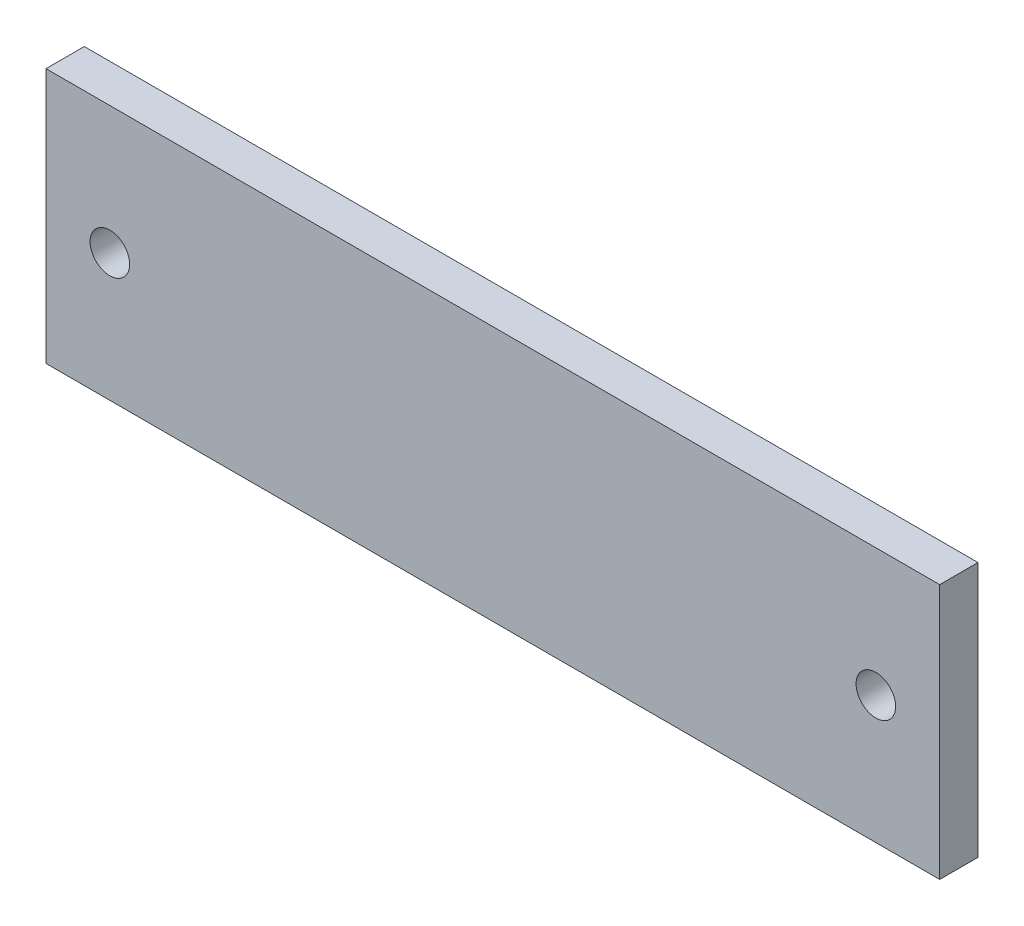
ISO-10303-21;
HEADER;
FILE_DESCRIPTION(('STEP AP214'),'2;1');
FILE_NAME('part.step','',(''),(''),'','','');
FILE_SCHEMA(('AUTOMOTIVE_DESIGN { 1 0 10303 214 1 1 1 1 }'));
ENDSEC;
DATA;
#1=APPLICATION_CONTEXT('core data for automotive mechanical design processes');
#2=APPLICATION_PROTOCOL_DEFINITION('international standard','automotive_design',2000,#1);
#3=PRODUCT_CONTEXT('',#1,'mechanical');
#4=PRODUCT('Part','Part','',(#3));
#5=PRODUCT_RELATED_PRODUCT_CATEGORY('part','',(#4));
#6=PRODUCT_DEFINITION_FORMATION('','',#4);
#7=PRODUCT_DEFINITION_CONTEXT('part definition',#1,'design');
#8=PRODUCT_DEFINITION('design','',#6,#7);
#9=PRODUCT_DEFINITION_SHAPE('','',#8);
#10=(LENGTH_UNIT() NAMED_UNIT(*) SI_UNIT(.MILLI.,.METRE.));
#11=(NAMED_UNIT(*) PLANE_ANGLE_UNIT() SI_UNIT($,.RADIAN.));
#12=(NAMED_UNIT(*) SI_UNIT($,.STERADIAN.) SOLID_ANGLE_UNIT());
#13=UNCERTAINTY_MEASURE_WITH_UNIT(LENGTH_MEASURE(1.E-05),#10,'distance_accuracy_value','');
#14=(GEOMETRIC_REPRESENTATION_CONTEXT(3) GLOBAL_UNCERTAINTY_ASSIGNED_CONTEXT((#13)) GLOBAL_UNIT_ASSIGNED_CONTEXT((#10,
#11,#12)) REPRESENTATION_CONTEXT('',''));
#15=CARTESIAN_POINT('',(0.,0.,0.));
#16=DIRECTION('',(0.,0.,1.));
#17=DIRECTION('',(1.,0.,0.));
#18=AXIS2_PLACEMENT_3D('',#15,#16,#17);
#19=CARTESIAN_POINT('',(0.,0.,3.));
#20=DIRECTION('',(0.,0.,-1.));
#21=DIRECTION('',(-1.,0.,0.));
#22=AXIS2_PLACEMENT_3D('',#19,#20,#21);
#23=PLANE('',#22);
#24=DIRECTION('',(0.,1.,0.));
#25=VECTOR('',#24,1.);
#26=CARTESIAN_POINT('',(35.,-10.,3.));
#27=LINE('',#26,#25);
#28=CARTESIAN_POINT('',(35.,-10.,3.));
#29=VERTEX_POINT('',#28);
#30=CARTESIAN_POINT('',(35.,10.,3.));
#31=VERTEX_POINT('',#30);
#32=EDGE_CURVE('E96',#29,#31,#27,.T.);
#33=ORIENTED_EDGE('',*,*,#32,.T.);
#34=DIRECTION('',(-1.,0.,0.));
#35=VECTOR('',#34,1.);
#36=CARTESIAN_POINT('',(-35.,10.,3.));
#37=LINE('',#36,#35);
#38=CARTESIAN_POINT('',(-35.,10.,3.));
#39=VERTEX_POINT('',#38);
#40=EDGE_CURVE('E91',#31,#39,#37,.T.);
#41=ORIENTED_EDGE('',*,*,#40,.T.);
#42=DIRECTION('',(0.,-1.,0.));
#43=VECTOR('',#42,1.);
#44=CARTESIAN_POINT('',(-35.,-10.,3.));
#45=LINE('',#44,#43);
#46=CARTESIAN_POINT('',(-35.,-10.,3.));
#47=VERTEX_POINT('',#46);
#48=EDGE_CURVE('E94',#39,#47,#45,.T.);
#49=ORIENTED_EDGE('',*,*,#48,.T.);
#50=DIRECTION('',(1.,0.,0.));
#51=VECTOR('',#50,1.);
#52=CARTESIAN_POINT('',(-35.,-10.,3.));
#53=LINE('',#52,#51);
#54=EDGE_CURVE('E61',#47,#29,#53,.T.);
#55=ORIENTED_EDGE('',*,*,#54,.T.);
#56=EDGE_LOOP('',(#33,#41,#49,#55));
#57=FACE_BOUND('',#56,.T.);
#58=CARTESIAN_POINT('',(30.,0.,3.));
#59=DIRECTION('',(0.,0.,1.));
#60=DIRECTION('',(1.,0.,0.));
#61=AXIS2_PLACEMENT_3D('',#58,#59,#60);
#62=CIRCLE('',#61,1.55);
#63=CARTESIAN_POINT('',(31.55,0.,3.));
#64=VERTEX_POINT('',#63);
#65=EDGE_CURVE('E116',#64,#64,#62,.T.);
#66=ORIENTED_EDGE('',*,*,#65,.F.);
#67=EDGE_LOOP('',(#66));
#68=FACE_BOUND('',#67,.T.);
#69=CARTESIAN_POINT('',(-30.,0.,3.));
#70=DIRECTION('',(0.,0.,1.));
#71=DIRECTION('',(-1.,0.,0.));
#72=AXIS2_PLACEMENT_3D('',#69,#70,#71);
#73=CIRCLE('',#72,1.55);
#74=CARTESIAN_POINT('',(-31.55,0.,3.));
#75=VERTEX_POINT('',#74);
#76=EDGE_CURVE('E138',#75,#75,#73,.T.);
#77=ORIENTED_EDGE('',*,*,#76,.F.);
#78=EDGE_LOOP('',(#77));
#79=FACE_BOUND('',#78,.T.);
#80=ADVANCED_FACE('F43',(#57,#68,#79),#23,.F.);
#81=CARTESIAN_POINT('',(0.,0.,0.));
#82=DIRECTION('',(0.,0.,-1.));
#83=DIRECTION('',(-1.,0.,0.));
#84=AXIS2_PLACEMENT_3D('',#81,#82,#83);
#85=PLANE('',#84);
#86=CARTESIAN_POINT('',(30.,0.,0.));
#87=DIRECTION('',(0.,0.,1.));
#88=DIRECTION('',(1.,0.,0.));
#89=AXIS2_PLACEMENT_3D('',#86,#87,#88);
#90=CIRCLE('',#89,1.55);
#91=CARTESIAN_POINT('',(31.55,0.,0.));
#92=VERTEX_POINT('',#91);
#93=EDGE_CURVE('E134',#92,#92,#90,.T.);
#94=ORIENTED_EDGE('',*,*,#93,.T.);
#95=EDGE_LOOP('',(#94));
#96=FACE_BOUND('',#95,.T.);
#97=DIRECTION('',(0.,1.,0.));
#98=VECTOR('',#97,1.);
#99=CARTESIAN_POINT('',(35.,-10.,0.));
#100=LINE('',#99,#98);
#101=CARTESIAN_POINT('',(35.,-10.,0.));
#102=VERTEX_POINT('',#101);
#103=CARTESIAN_POINT('',(35.,10.,0.));
#104=VERTEX_POINT('',#103);
#105=EDGE_CURVE('E112',#102,#104,#100,.T.);
#106=ORIENTED_EDGE('',*,*,#105,.F.);
#107=DIRECTION('',(1.,0.,0.));
#108=VECTOR('',#107,1.);
#109=CARTESIAN_POINT('',(-35.,-10.,0.));
#110=LINE('',#109,#108);
#111=CARTESIAN_POINT('',(-35.,-10.,0.));
#112=VERTEX_POINT('',#111);
#113=EDGE_CURVE('E84',#112,#102,#110,.T.);
#114=ORIENTED_EDGE('',*,*,#113,.F.);
#115=DIRECTION('',(0.,-1.,0.));
#116=VECTOR('',#115,1.);
#117=CARTESIAN_POINT('',(-35.,-10.,0.));
#118=LINE('',#117,#116);
#119=CARTESIAN_POINT('',(-35.,10.,0.));
#120=VERTEX_POINT('',#119);
#121=EDGE_CURVE('E78',#120,#112,#118,.T.);
#122=ORIENTED_EDGE('',*,*,#121,.F.);
#123=DIRECTION('',(-1.,0.,0.));
#124=VECTOR('',#123,1.);
#125=CARTESIAN_POINT('',(-35.,10.,0.));
#126=LINE('',#125,#124);
#127=EDGE_CURVE('E101',#104,#120,#126,.T.);
#128=ORIENTED_EDGE('',*,*,#127,.F.);
#129=EDGE_LOOP('',(#106,#114,#122,#128));
#130=FACE_BOUND('',#129,.T.);
#131=CARTESIAN_POINT('',(-30.,0.,0.));
#132=DIRECTION('',(0.,0.,1.));
#133=DIRECTION('',(-1.,0.,0.));
#134=AXIS2_PLACEMENT_3D('',#131,#132,#133);
#135=CIRCLE('',#134,1.55);
#136=CARTESIAN_POINT('',(-31.55,0.,0.));
#137=VERTEX_POINT('',#136);
#138=EDGE_CURVE('E142',#137,#137,#135,.T.);
#139=ORIENTED_EDGE('',*,*,#138,.T.);
#140=EDGE_LOOP('',(#139));
#141=FACE_BOUND('',#140,.T.);
#142=ADVANCED_FACE('F129',(#96,#130,#141),#85,.T.);
#143=CARTESIAN_POINT('',(35.,-10.,3.));
#144=DIRECTION('',(-1.,0.,0.));
#145=DIRECTION('',(0.,0.,1.));
#146=AXIS2_PLACEMENT_3D('',#143,#144,#145);
#147=PLANE('',#146);
#148=ORIENTED_EDGE('',*,*,#105,.T.);
#149=DIRECTION('',(0.,0.,-1.));
#150=VECTOR('',#149,1.);
#151=CARTESIAN_POINT('',(35.,10.,3.));
#152=LINE('',#151,#150);
#153=EDGE_CURVE('E11',#31,#104,#152,.T.);
#154=ORIENTED_EDGE('',*,*,#153,.F.);
#155=ORIENTED_EDGE('',*,*,#32,.F.);
#156=DIRECTION('',(0.,0.,-1.));
#157=VECTOR('',#156,1.);
#158=CARTESIAN_POINT('',(35.,-10.,3.));
#159=LINE('',#158,#157);
#160=EDGE_CURVE('E108',#29,#102,#159,.T.);
#161=ORIENTED_EDGE('',*,*,#160,.T.);
#162=EDGE_LOOP('',(#148,#154,#155,#161));
#163=FACE_BOUND('',#162,.T.);
#164=ADVANCED_FACE('F45',(#163),#147,.F.);
#165=CARTESIAN_POINT('',(-35.,10.,3.));
#166=DIRECTION('',(0.,-1.,0.));
#167=DIRECTION('',(0.,0.,-1.));
#168=AXIS2_PLACEMENT_3D('',#165,#166,#167);
#169=PLANE('',#168);
#170=ORIENTED_EDGE('',*,*,#127,.T.);
#171=DIRECTION('',(0.,0.,-1.));
#172=VECTOR('',#171,1.);
#173=CARTESIAN_POINT('',(-35.,10.,3.));
#174=LINE('',#173,#172);
#175=EDGE_CURVE('E53',#39,#120,#174,.T.);
#176=ORIENTED_EDGE('',*,*,#175,.F.);
#177=ORIENTED_EDGE('',*,*,#40,.F.);
#178=ORIENTED_EDGE('',*,*,#153,.T.);
#179=EDGE_LOOP('',(#170,#176,#177,#178));
#180=FACE_BOUND('',#179,.T.);
#181=ADVANCED_FACE('F100',(#180),#169,.F.);
#182=CARTESIAN_POINT('',(-35.,-10.,3.));
#183=DIRECTION('',(1.,0.,0.));
#184=DIRECTION('',(0.,0.,-1.));
#185=AXIS2_PLACEMENT_3D('',#182,#183,#184);
#186=PLANE('',#185);
#187=ORIENTED_EDGE('',*,*,#121,.T.);
#188=DIRECTION('',(0.,0.,-1.));
#189=VECTOR('',#188,1.);
#190=CARTESIAN_POINT('',(-35.,-10.,3.));
#191=LINE('',#190,#189);
#192=EDGE_CURVE('E103',#47,#112,#191,.T.);
#193=ORIENTED_EDGE('',*,*,#192,.F.);
#194=ORIENTED_EDGE('',*,*,#48,.F.);
#195=ORIENTED_EDGE('',*,*,#175,.T.);
#196=EDGE_LOOP('',(#187,#193,#194,#195));
#197=FACE_BOUND('',#196,.T.);
#198=ADVANCED_FACE('F104',(#197),#186,.F.);
#199=CARTESIAN_POINT('',(-35.,-10.,3.));
#200=DIRECTION('',(0.,1.,0.));
#201=DIRECTION('',(0.,0.,1.));
#202=AXIS2_PLACEMENT_3D('',#199,#200,#201);
#203=PLANE('',#202);
#204=ORIENTED_EDGE('',*,*,#113,.T.);
#205=ORIENTED_EDGE('',*,*,#160,.F.);
#206=ORIENTED_EDGE('',*,*,#54,.F.);
#207=ORIENTED_EDGE('',*,*,#192,.T.);
#208=EDGE_LOOP('',(#204,#205,#206,#207));
#209=FACE_BOUND('',#208,.T.);
#210=ADVANCED_FACE('F126',(#209),#203,.F.);
#211=CARTESIAN_POINT('',(30.,0.,3.));
#212=DIRECTION('',(0.,0.,-1.));
#213=DIRECTION('',(-1.,0.,0.));
#214=AXIS2_PLACEMENT_3D('',#211,#212,#213);
#215=CYLINDRICAL_SURFACE('',#214,1.55);
#216=ORIENTED_EDGE('',*,*,#65,.T.);
#217=EDGE_LOOP('',(#216));
#218=FACE_BOUND('',#217,.T.);
#219=ORIENTED_EDGE('',*,*,#93,.F.);
#220=EDGE_LOOP('',(#219));
#221=FACE_BOUND('',#220,.T.);
#222=ADVANCED_FACE('F161',(#218,#221),#215,.F.);
#223=CARTESIAN_POINT('',(-30.,0.,3.));
#224=DIRECTION('',(0.,0.,-1.));
#225=DIRECTION('',(-1.,0.,0.));
#226=AXIS2_PLACEMENT_3D('',#223,#224,#225);
#227=CYLINDRICAL_SURFACE('',#226,1.55);
#228=ORIENTED_EDGE('',*,*,#76,.T.);
#229=EDGE_LOOP('',(#228));
#230=FACE_BOUND('',#229,.T.);
#231=ORIENTED_EDGE('',*,*,#138,.F.);
#232=EDGE_LOOP('',(#231));
#233=FACE_BOUND('',#232,.T.);
#234=ADVANCED_FACE('F150',(#230,#233),#227,.F.);
#235=CLOSED_SHELL('',(#80,#142,#164,#181,#198,#210,#222,#234));
#236=MANIFOLD_SOLID_BREP('B2',#235);
#237=ADVANCED_BREP_SHAPE_REPRESENTATION('',(#18,#236),#14);
#238=SHAPE_DEFINITION_REPRESENTATION(#9,#237);
ENDSEC;
END-ISO-10303-21;
